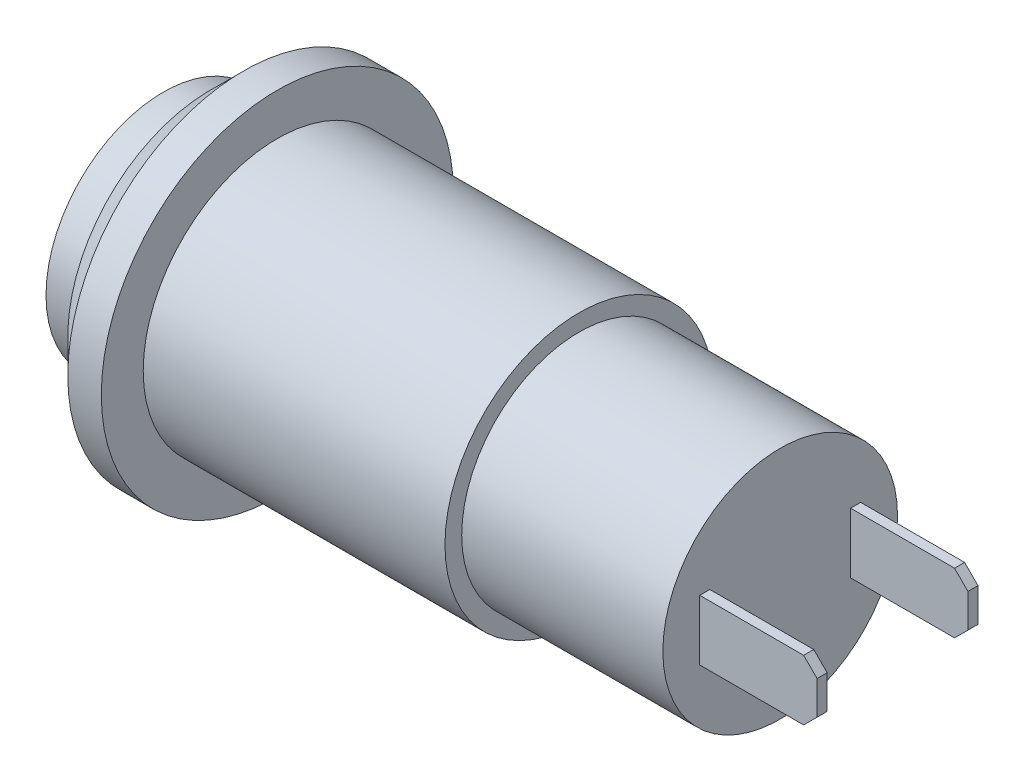
ISO-10303-21;
HEADER;
FILE_DESCRIPTION(('STEP AP214'),'2;1');
FILE_NAME('part.step','',(''),(''),'','','');
FILE_SCHEMA(('AUTOMOTIVE_DESIGN { 1 0 10303 214 1 1 1 1 }'));
ENDSEC;
DATA;
#1=APPLICATION_CONTEXT('core data for automotive mechanical design processes');
#2=APPLICATION_PROTOCOL_DEFINITION('international standard','automotive_design',2000,#1);
#3=PRODUCT_CONTEXT('',#1,'mechanical');
#4=PRODUCT('Part','Part','',(#3));
#5=PRODUCT_RELATED_PRODUCT_CATEGORY('part','',(#4));
#6=PRODUCT_DEFINITION_FORMATION('','',#4);
#7=PRODUCT_DEFINITION_CONTEXT('part definition',#1,'design');
#8=PRODUCT_DEFINITION('design','',#6,#7);
#9=PRODUCT_DEFINITION_SHAPE('','',#8);
#10=(LENGTH_UNIT() NAMED_UNIT(*) SI_UNIT(.MILLI.,.METRE.));
#11=(NAMED_UNIT(*) PLANE_ANGLE_UNIT() SI_UNIT($,.RADIAN.));
#12=(NAMED_UNIT(*) SI_UNIT($,.STERADIAN.) SOLID_ANGLE_UNIT());
#13=UNCERTAINTY_MEASURE_WITH_UNIT(LENGTH_MEASURE(1.E-05),#10,'distance_accuracy_value','');
#14=(GEOMETRIC_REPRESENTATION_CONTEXT(3) GLOBAL_UNCERTAINTY_ASSIGNED_CONTEXT((#13)) GLOBAL_UNIT_ASSIGNED_CONTEXT((#10,
#11,#12)) REPRESENTATION_CONTEXT('',''));
#15=CARTESIAN_POINT('',(0.,0.,0.));
#16=DIRECTION('',(0.,0.,1.));
#17=DIRECTION('',(1.,0.,0.));
#18=AXIS2_PLACEMENT_3D('',#15,#16,#17);
#19=CARTESIAN_POINT('',(18.4,0.,0.));
#20=DIRECTION('',(-1.,0.,0.));
#21=DIRECTION('',(0.,0.,1.));
#22=AXIS2_PLACEMENT_3D('',#19,#20,#21);
#23=PLANE('',#22);
#24=DIRECTION('',(0.,1.,0.));
#25=VECTOR('',#24,1.);
#26=CARTESIAN_POINT('',(18.4,0.900000000000001,-2.4));
#27=LINE('',#26,#25);
#28=CARTESIAN_POINT('',(18.4,-0.899999999999999,-2.4));
#29=VERTEX_POINT('',#28);
#30=CARTESIAN_POINT('',(18.4,0.900000000000001,-2.4));
#31=VERTEX_POINT('',#30);
#32=EDGE_CURVE('E174',#29,#31,#27,.T.);
#33=ORIENTED_EDGE('',*,*,#32,.F.);
#34=DIRECTION('',(0.,0.,-1.));
#35=VECTOR('',#34,1.);
#36=CARTESIAN_POINT('',(18.4,-0.899999999999999,-2.1));
#37=LINE('',#36,#35);
#38=CARTESIAN_POINT('',(18.4,-0.899999999999999,-2.1));
#39=VERTEX_POINT('',#38);
#40=EDGE_CURVE('E180',#39,#29,#37,.T.);
#41=ORIENTED_EDGE('',*,*,#40,.F.);
#42=DIRECTION('',(0.,-1.,0.));
#43=VECTOR('',#42,1.);
#44=CARTESIAN_POINT('',(18.4,0.900000000000001,-2.1));
#45=LINE('',#44,#43);
#46=CARTESIAN_POINT('',(18.4,0.900000000000001,-2.1));
#47=VERTEX_POINT('',#46);
#48=EDGE_CURVE('E192',#47,#39,#45,.T.);
#49=ORIENTED_EDGE('',*,*,#48,.F.);
#50=DIRECTION('',(0.,0.,1.));
#51=VECTOR('',#50,1.);
#52=CARTESIAN_POINT('',(18.4,0.900000000000001,-2.1));
#53=LINE('',#52,#51);
#54=EDGE_CURVE('E188',#31,#47,#53,.T.);
#55=ORIENTED_EDGE('',*,*,#54,.F.);
#56=EDGE_LOOP('',(#33,#41,#49,#55));
#57=FACE_BOUND('',#56,.T.);
#58=CARTESIAN_POINT('',(18.4,0.,0.));
#59=DIRECTION('',(-1.,0.,0.));
#60=DIRECTION('',(0.,0.,1.));
#61=AXIS2_PLACEMENT_3D('',#58,#59,#60);
#62=CIRCLE('',#61,3.5);
#63=CARTESIAN_POINT('',(18.4,0.,3.5));
#64=VERTEX_POINT('',#63);
#65=EDGE_CURVE('E234',#64,#64,#62,.T.);
#66=ORIENTED_EDGE('',*,*,#65,.F.);
#67=EDGE_LOOP('',(#66));
#68=FACE_BOUND('',#67,.T.);
#69=DIRECTION('',(0.,0.,1.));
#70=VECTOR('',#69,1.);
#71=CARTESIAN_POINT('',(18.4,0.899999999999999,2.1));
#72=LINE('',#71,#70);
#73=CARTESIAN_POINT('',(18.4,0.899999999999999,2.1));
#74=VERTEX_POINT('',#73);
#75=CARTESIAN_POINT('',(18.4,0.899999999999999,2.4));
#76=VERTEX_POINT('',#75);
#77=EDGE_CURVE('E134',#74,#76,#72,.T.);
#78=ORIENTED_EDGE('',*,*,#77,.F.);
#79=DIRECTION('',(0.,1.,0.));
#80=VECTOR('',#79,1.);
#81=CARTESIAN_POINT('',(18.4,0.899999999999999,2.1));
#82=LINE('',#81,#80);
#83=CARTESIAN_POINT('',(18.4,-0.899999999999999,2.1));
#84=VERTEX_POINT('',#83);
#85=EDGE_CURVE('E147',#84,#74,#82,.T.);
#86=ORIENTED_EDGE('',*,*,#85,.F.);
#87=DIRECTION('',(0.,0.,-1.));
#88=VECTOR('',#87,1.);
#89=CARTESIAN_POINT('',(18.4,-0.899999999999999,2.1));
#90=LINE('',#89,#88);
#91=CARTESIAN_POINT('',(18.4,-0.899999999999999,2.4));
#92=VERTEX_POINT('',#91);
#93=EDGE_CURVE('E157',#92,#84,#90,.T.);
#94=ORIENTED_EDGE('',*,*,#93,.F.);
#95=DIRECTION('',(0.,-1.,0.));
#96=VECTOR('',#95,1.);
#97=CARTESIAN_POINT('',(18.4,0.899999999999999,2.4));
#98=LINE('',#97,#96);
#99=EDGE_CURVE('E150',#76,#92,#98,.T.);
#100=ORIENTED_EDGE('',*,*,#99,.F.);
#101=EDGE_LOOP('',(#78,#86,#94,#100));
#102=FACE_BOUND('',#101,.T.);
#103=ADVANCED_FACE('F41',(#57,#68,#102),#23,.F.);
#104=CARTESIAN_POINT('',(0.,0.,0.));
#105=DIRECTION('',(-1.,0.,0.));
#106=DIRECTION('',(0.,0.,1.));
#107=AXIS2_PLACEMENT_3D('',#104,#105,#106);
#108=CYLINDRICAL_SURFACE('',#107,3.5);
#109=CARTESIAN_POINT('',(12.4,0.,0.));
#110=DIRECTION('',(-1.,0.,0.));
#111=DIRECTION('',(0.,0.,1.));
#112=AXIS2_PLACEMENT_3D('',#109,#110,#111);
#113=CIRCLE('',#112,3.5);
#114=CARTESIAN_POINT('',(12.4,0.,3.5));
#115=VERTEX_POINT('',#114);
#116=EDGE_CURVE('E230',#115,#115,#113,.T.);
#117=ORIENTED_EDGE('',*,*,#116,.F.);
#118=EDGE_LOOP('',(#117));
#119=FACE_BOUND('',#118,.T.);
#120=ORIENTED_EDGE('',*,*,#65,.T.);
#121=EDGE_LOOP('',(#120));
#122=FACE_BOUND('',#121,.T.);
#123=ADVANCED_FACE('F310',(#119,#122),#108,.T.);
#124=CARTESIAN_POINT('',(12.4,3.5,0.));
#125=DIRECTION('',(-1.,0.,0.));
#126=DIRECTION('',(0.,0.,1.));
#127=AXIS2_PLACEMENT_3D('',#124,#125,#126);
#128=PLANE('',#127);
#129=CARTESIAN_POINT('',(12.4,0.,0.));
#130=DIRECTION('',(-1.,0.,0.));
#131=DIRECTION('',(0.,0.,1.));
#132=AXIS2_PLACEMENT_3D('',#129,#130,#131);
#133=CIRCLE('',#132,4.);
#134=CARTESIAN_POINT('',(12.4,0.,4.));
#135=VERTEX_POINT('',#134);
#136=EDGE_CURVE('E226',#135,#135,#133,.T.);
#137=ORIENTED_EDGE('',*,*,#136,.F.);
#138=EDGE_LOOP('',(#137));
#139=FACE_BOUND('',#138,.T.);
#140=ORIENTED_EDGE('',*,*,#116,.T.);
#141=EDGE_LOOP('',(#140));
#142=FACE_BOUND('',#141,.T.);
#143=ADVANCED_FACE('F316',(#139,#142),#128,.F.);
#144=CARTESIAN_POINT('',(0.,0.,0.));
#145=DIRECTION('',(-1.,0.,0.));
#146=DIRECTION('',(0.,0.,1.));
#147=AXIS2_PLACEMENT_3D('',#144,#145,#146);
#148=CYLINDRICAL_SURFACE('',#147,4.);
#149=CARTESIAN_POINT('',(3.4,0.,0.));
#150=DIRECTION('',(-1.,0.,0.));
#151=DIRECTION('',(0.,0.,1.));
#152=AXIS2_PLACEMENT_3D('',#149,#150,#151);
#153=CIRCLE('',#152,4.);
#154=CARTESIAN_POINT('',(3.4,0.,4.));
#155=VERTEX_POINT('',#154);
#156=EDGE_CURVE('E222',#155,#155,#153,.T.);
#157=ORIENTED_EDGE('',*,*,#156,.F.);
#158=EDGE_LOOP('',(#157));
#159=FACE_BOUND('',#158,.T.);
#160=ORIENTED_EDGE('',*,*,#136,.T.);
#161=EDGE_LOOP('',(#160));
#162=FACE_BOUND('',#161,.T.);
#163=ADVANCED_FACE('F389',(#159,#162),#148,.T.);
#164=CARTESIAN_POINT('',(3.4,4.,0.));
#165=DIRECTION('',(-1.,0.,0.));
#166=DIRECTION('',(0.,0.,1.));
#167=AXIS2_PLACEMENT_3D('',#164,#165,#166);
#168=PLANE('',#167);
#169=CARTESIAN_POINT('',(3.4,0.,0.));
#170=DIRECTION('',(-1.,0.,0.));
#171=DIRECTION('',(0.,0.,1.));
#172=AXIS2_PLACEMENT_3D('',#169,#170,#171);
#173=CIRCLE('',#172,5.25);
#174=CARTESIAN_POINT('',(3.4,0.,5.25));
#175=VERTEX_POINT('',#174);
#176=EDGE_CURVE('E218',#175,#175,#173,.T.);
#177=ORIENTED_EDGE('',*,*,#176,.F.);
#178=EDGE_LOOP('',(#177));
#179=FACE_BOUND('',#178,.T.);
#180=ORIENTED_EDGE('',*,*,#156,.T.);
#181=EDGE_LOOP('',(#180));
#182=FACE_BOUND('',#181,.T.);
#183=ADVANCED_FACE('F385',(#179,#182),#168,.F.);
#184=CARTESIAN_POINT('',(0.,0.,0.));
#185=DIRECTION('',(-1.,0.,0.));
#186=DIRECTION('',(0.,0.,1.));
#187=AXIS2_PLACEMENT_3D('',#184,#185,#186);
#188=CYLINDRICAL_SURFACE('',#187,5.25);
#189=CARTESIAN_POINT('',(2.4,0.,0.));
#190=DIRECTION('',(1.,0.,0.));
#191=DIRECTION('',(0.,0.,-1.));
#192=AXIS2_PLACEMENT_3D('',#189,#190,#191);
#193=CIRCLE('',#192,5.25);
#194=CARTESIAN_POINT('',(2.4,0.,-5.25));
#195=VERTEX_POINT('',#194);
#196=EDGE_CURVE('E242',#195,#195,#193,.T.);
#197=ORIENTED_EDGE('',*,*,#196,.T.);
#198=EDGE_LOOP('',(#197));
#199=FACE_BOUND('',#198,.T.);
#200=ORIENTED_EDGE('',*,*,#176,.T.);
#201=EDGE_LOOP('',(#200));
#202=FACE_BOUND('',#201,.T.);
#203=ADVANCED_FACE('F381',(#199,#202),#188,.T.);
#204=CARTESIAN_POINT('',(1.4,5.25,0.));
#205=DIRECTION('',(1.,0.,0.));
#206=DIRECTION('',(0.,0.,-1.));
#207=AXIS2_PLACEMENT_3D('',#204,#205,#206);
#208=PLANE('',#207);
#209=CARTESIAN_POINT('',(1.4,0.,0.));
#210=DIRECTION('',(1.,0.,0.));
#211=DIRECTION('',(0.,0.,-1.));
#212=AXIS2_PLACEMENT_3D('',#209,#210,#211);
#213=CIRCLE('',#212,4.25000000000001);
#214=CARTESIAN_POINT('',(1.4,0.,-4.25000000000001));
#215=VERTEX_POINT('',#214);
#216=EDGE_CURVE('E238',#215,#215,#213,.F.);
#217=ORIENTED_EDGE('',*,*,#216,.T.);
#218=EDGE_LOOP('',(#217));
#219=FACE_BOUND('',#218,.T.);
#220=CARTESIAN_POINT('',(1.4,0.,0.));
#221=DIRECTION('',(-1.,0.,0.));
#222=DIRECTION('',(0.,0.,1.));
#223=AXIS2_PLACEMENT_3D('',#220,#221,#222);
#224=CIRCLE('',#223,3.5);
#225=CARTESIAN_POINT('',(1.4,0.,3.5));
#226=VERTEX_POINT('',#225);
#227=EDGE_CURVE('E214',#226,#226,#224,.T.);
#228=ORIENTED_EDGE('',*,*,#227,.F.);
#229=EDGE_LOOP('',(#228));
#230=FACE_BOUND('',#229,.T.);
#231=ADVANCED_FACE('F377',(#219,#230),#208,.F.);
#232=CARTESIAN_POINT('',(0.,0.,0.));
#233=DIRECTION('',(-1.,0.,0.));
#234=DIRECTION('',(0.,0.,1.));
#235=AXIS2_PLACEMENT_3D('',#232,#233,#234);
#236=CYLINDRICAL_SURFACE('',#235,3.5);
#237=CARTESIAN_POINT('',(0.,0.,0.));
#238=DIRECTION('',(-1.,0.,0.));
#239=DIRECTION('',(0.,0.,1.));
#240=AXIS2_PLACEMENT_3D('',#237,#238,#239);
#241=CIRCLE('',#240,3.5);
#242=CARTESIAN_POINT('',(0.,0.,3.5));
#243=VERTEX_POINT('',#242);
#244=EDGE_CURVE('E210',#243,#243,#241,.T.);
#245=ORIENTED_EDGE('',*,*,#244,.F.);
#246=EDGE_LOOP('',(#245));
#247=FACE_BOUND('',#246,.T.);
#248=ORIENTED_EDGE('',*,*,#227,.T.);
#249=EDGE_LOOP('',(#248));
#250=FACE_BOUND('',#249,.T.);
#251=ADVANCED_FACE('F373',(#247,#250),#236,.T.);
#252=CARTESIAN_POINT('',(0.,3.5,0.));
#253=DIRECTION('',(1.,0.,0.));
#254=DIRECTION('',(0.,0.,-1.));
#255=AXIS2_PLACEMENT_3D('',#252,#253,#254);
#256=PLANE('',#255);
#257=ORIENTED_EDGE('',*,*,#244,.T.);
#258=EDGE_LOOP('',(#257));
#259=FACE_BOUND('',#258,.T.);
#260=ADVANCED_FACE('F327',(#259),#256,.F.);
#261=CARTESIAN_POINT('',(1.4,0.,0.));
#262=DIRECTION('',(1.,0.,0.));
#263=DIRECTION('',(0.,0.,-1.));
#264=AXIS2_PLACEMENT_3D('',#261,#262,#263);
#265=CONICAL_SURFACE('',#264,4.25000000000001,0.785398163397444);
#266=ORIENTED_EDGE('',*,*,#196,.F.);
#267=EDGE_LOOP('',(#266));
#268=FACE_BOUND('',#267,.T.);
#269=ORIENTED_EDGE('',*,*,#216,.F.);
#270=EDGE_LOOP('',(#269));
#271=FACE_BOUND('',#270,.T.);
#272=ADVANCED_FACE('F323',(#268,#271),#265,.T.);
#273=CARTESIAN_POINT('',(21.9,0.900000000000001,-2.4));
#274=DIRECTION('',(0.,0.,1.));
#275=DIRECTION('',(1.,0.,0.));
#276=AXIS2_PLACEMENT_3D('',#273,#274,#275);
#277=PLANE('',#276);
#278=DIRECTION('',(0.,1.,0.));
#279=VECTOR('',#278,1.);
#280=CARTESIAN_POINT('',(21.9,0.900000000000001,-2.4));
#281=LINE('',#280,#279);
#282=CARTESIAN_POINT('',(21.9,-0.500000000000001,-2.4));
#283=VERTEX_POINT('',#282);
#284=CARTESIAN_POINT('',(21.9,0.500000000000004,-2.4));
#285=VERTEX_POINT('',#284);
#286=EDGE_CURVE('E175',#283,#285,#281,.T.);
#287=ORIENTED_EDGE('',*,*,#286,.F.);
#288=DIRECTION('',(-0.707106781186551,-0.707106781186544,0.));
#289=VECTOR('',#288,1.);
#290=CARTESIAN_POINT('',(21.9,-0.500000000000001,-2.4));
#291=LINE('',#290,#289);
#292=CARTESIAN_POINT('',(21.5,-0.899999999999999,-2.4));
#293=VERTEX_POINT('',#292);
#294=EDGE_CURVE('E257',#283,#293,#291,.T.);
#295=ORIENTED_EDGE('',*,*,#294,.T.);
#296=DIRECTION('',(-1.,0.,0.));
#297=VECTOR('',#296,1.);
#298=CARTESIAN_POINT('',(21.9,-0.899999999999999,-2.4));
#299=LINE('',#298,#297);
#300=EDGE_CURVE('E184',#293,#29,#299,.T.);
#301=ORIENTED_EDGE('',*,*,#300,.T.);
#302=ORIENTED_EDGE('',*,*,#32,.T.);
#303=DIRECTION('',(-1.,0.,0.));
#304=VECTOR('',#303,1.);
#305=CARTESIAN_POINT('',(21.9,0.900000000000001,-2.4));
#306=LINE('',#305,#304);
#307=CARTESIAN_POINT('',(21.5,0.900000000000001,-2.4));
#308=VERTEX_POINT('',#307);
#309=EDGE_CURVE('E207',#308,#31,#306,.T.);
#310=ORIENTED_EDGE('',*,*,#309,.F.);
#311=DIRECTION('',(0.707106781186551,-0.707106781186544,0.));
#312=VECTOR('',#311,1.);
#313=CARTESIAN_POINT('',(21.9,0.500000000000004,-2.4));
#314=LINE('',#313,#312);
#315=EDGE_CURVE('E254',#308,#285,#314,.T.);
#316=ORIENTED_EDGE('',*,*,#315,.T.);
#317=EDGE_LOOP('',(#287,#295,#301,#302,#310,#316));
#318=FACE_BOUND('',#317,.T.);
#319=ADVANCED_FACE('F326',(#318),#277,.F.);
#320=CARTESIAN_POINT('',(21.9,0.900000000000001,-2.1));
#321=DIRECTION('',(0.,-1.,0.));
#322=DIRECTION('',(0.,0.,-1.));
#323=AXIS2_PLACEMENT_3D('',#320,#321,#322);
#324=PLANE('',#323);
#325=DIRECTION('',(-1.,0.,0.));
#326=VECTOR('',#325,1.);
#327=CARTESIAN_POINT('',(21.9,0.900000000000001,-2.1));
#328=LINE('',#327,#326);
#329=CARTESIAN_POINT('',(21.5,0.900000000000001,-2.1));
#330=VERTEX_POINT('',#329);
#331=EDGE_CURVE('E204',#330,#47,#328,.T.);
#332=ORIENTED_EDGE('',*,*,#331,.F.);
#333=DIRECTION('',(0.,0.,-1.));
#334=VECTOR('',#333,1.);
#335=CARTESIAN_POINT('',(21.5,0.900000000000001,-2.4));
#336=LINE('',#335,#334);
#337=EDGE_CURVE('E269',#330,#308,#336,.T.);
#338=ORIENTED_EDGE('',*,*,#337,.T.);
#339=ORIENTED_EDGE('',*,*,#309,.T.);
#340=ORIENTED_EDGE('',*,*,#54,.T.);
#341=EDGE_LOOP('',(#332,#338,#339,#340));
#342=FACE_BOUND('',#341,.T.);
#343=ADVANCED_FACE('F360',(#342),#324,.F.);
#344=CARTESIAN_POINT('',(21.9,0.900000000000001,-2.1));
#345=DIRECTION('',(0.,0.,-1.));
#346=DIRECTION('',(0.,1.,0.));
#347=AXIS2_PLACEMENT_3D('',#344,#345,#346);
#348=PLANE('',#347);
#349=DIRECTION('',(-1.,0.,0.));
#350=VECTOR('',#349,1.);
#351=CARTESIAN_POINT('',(21.9,-0.899999999999999,-2.1));
#352=LINE('',#351,#350);
#353=CARTESIAN_POINT('',(21.5,-0.899999999999999,-2.1));
#354=VERTEX_POINT('',#353);
#355=EDGE_CURVE('E201',#354,#39,#352,.T.);
#356=ORIENTED_EDGE('',*,*,#355,.F.);
#357=DIRECTION('',(0.707106781186551,0.707106781186544,0.));
#358=VECTOR('',#357,1.);
#359=CARTESIAN_POINT('',(21.9,-0.500000000000001,-2.1));
#360=LINE('',#359,#358);
#361=CARTESIAN_POINT('',(21.9,-0.500000000000001,-2.1));
#362=VERTEX_POINT('',#361);
#363=EDGE_CURVE('E266',#354,#362,#360,.T.);
#364=ORIENTED_EDGE('',*,*,#363,.T.);
#365=DIRECTION('',(0.,-1.,0.));
#366=VECTOR('',#365,1.);
#367=CARTESIAN_POINT('',(21.9,0.900000000000001,-2.1));
#368=LINE('',#367,#366);
#369=CARTESIAN_POINT('',(21.9,0.500000000000004,-2.1));
#370=VERTEX_POINT('',#369);
#371=EDGE_CURVE('E179',#370,#362,#368,.T.);
#372=ORIENTED_EDGE('',*,*,#371,.F.);
#373=DIRECTION('',(-0.707106781186551,0.707106781186544,0.));
#374=VECTOR('',#373,1.);
#375=CARTESIAN_POINT('',(21.9,0.500000000000004,-2.1));
#376=LINE('',#375,#374);
#377=EDGE_CURVE('E263',#370,#330,#376,.T.);
#378=ORIENTED_EDGE('',*,*,#377,.T.);
#379=ORIENTED_EDGE('',*,*,#331,.T.);
#380=ORIENTED_EDGE('',*,*,#48,.T.);
#381=EDGE_LOOP('',(#356,#364,#372,#378,#379,#380));
#382=FACE_BOUND('',#381,.T.);
#383=ADVANCED_FACE('F357',(#382),#348,.F.);
#384=CARTESIAN_POINT('',(21.9,-0.899999999999999,-2.1));
#385=DIRECTION('',(0.,1.,0.));
#386=DIRECTION('',(0.,0.,1.));
#387=AXIS2_PLACEMENT_3D('',#384,#385,#386);
#388=PLANE('',#387);
#389=ORIENTED_EDGE('',*,*,#300,.F.);
#390=DIRECTION('',(0.,0.,1.));
#391=VECTOR('',#390,1.);
#392=CARTESIAN_POINT('',(21.5,-0.899999999999999,-2.1));
#393=LINE('',#392,#391);
#394=EDGE_CURVE('E260',#293,#354,#393,.T.);
#395=ORIENTED_EDGE('',*,*,#394,.T.);
#396=ORIENTED_EDGE('',*,*,#355,.T.);
#397=ORIENTED_EDGE('',*,*,#40,.T.);
#398=EDGE_LOOP('',(#389,#395,#396,#397));
#399=FACE_BOUND('',#398,.T.);
#400=ADVANCED_FACE('F351',(#399),#388,.F.);
#401=CARTESIAN_POINT('',(21.9,0.,0.));
#402=DIRECTION('',(1.,0.,0.));
#403=DIRECTION('',(0.,0.,-1.));
#404=AXIS2_PLACEMENT_3D('',#401,#402,#403);
#405=PLANE('',#404);
#406=ORIENTED_EDGE('',*,*,#371,.T.);
#407=DIRECTION('',(0.,0.,-1.));
#408=VECTOR('',#407,1.);
#409=CARTESIAN_POINT('',(21.9,-0.500000000000001,-2.4));
#410=LINE('',#409,#408);
#411=EDGE_CURVE('E250',#362,#283,#410,.T.);
#412=ORIENTED_EDGE('',*,*,#411,.T.);
#413=ORIENTED_EDGE('',*,*,#286,.T.);
#414=DIRECTION('',(0.,0.,1.));
#415=VECTOR('',#414,1.);
#416=CARTESIAN_POINT('',(21.9,0.500000000000004,-2.1));
#417=LINE('',#416,#415);
#418=EDGE_CURVE('E246',#285,#370,#417,.T.);
#419=ORIENTED_EDGE('',*,*,#418,.T.);
#420=EDGE_LOOP('',(#406,#412,#413,#419));
#421=FACE_BOUND('',#420,.T.);
#422=ADVANCED_FACE('F344',(#421),#405,.T.);
#423=CARTESIAN_POINT('',(21.9,0.899999999999999,2.1));
#424=DIRECTION('',(0.,-1.,0.));
#425=DIRECTION('',(0.,0.,-1.));
#426=AXIS2_PLACEMENT_3D('',#423,#424,#425);
#427=PLANE('',#426);
#428=DIRECTION('',(-1.,0.,0.));
#429=VECTOR('',#428,1.);
#430=CARTESIAN_POINT('',(21.9,0.899999999999999,2.4));
#431=LINE('',#430,#429);
#432=CARTESIAN_POINT('',(21.5,0.899999999999999,2.4));
#433=VERTEX_POINT('',#432);
#434=EDGE_CURVE('E171',#433,#76,#431,.T.);
#435=ORIENTED_EDGE('',*,*,#434,.F.);
#436=DIRECTION('',(0.,0.,-1.));
#437=VECTOR('',#436,1.);
#438=CARTESIAN_POINT('',(21.5,0.899999999999999,2.1));
#439=LINE('',#438,#437);
#440=CARTESIAN_POINT('',(21.5,0.899999999999999,2.1));
#441=VERTEX_POINT('',#440);
#442=EDGE_CURVE('E11',#433,#441,#439,.T.);
#443=ORIENTED_EDGE('',*,*,#442,.T.);
#444=DIRECTION('',(-1.,0.,0.));
#445=VECTOR('',#444,1.);
#446=CARTESIAN_POINT('',(21.9,0.899999999999999,2.1));
#447=LINE('',#446,#445);
#448=EDGE_CURVE('E131',#441,#74,#447,.T.);
#449=ORIENTED_EDGE('',*,*,#448,.T.);
#450=ORIENTED_EDGE('',*,*,#77,.T.);
#451=EDGE_LOOP('',(#435,#443,#449,#450));
#452=FACE_BOUND('',#451,.T.);
#453=ADVANCED_FACE('F133',(#452),#427,.F.);
#454=CARTESIAN_POINT('',(21.9,0.899999999999999,2.4));
#455=DIRECTION('',(0.,0.,-1.));
#456=DIRECTION('',(-1.,0.,0.));
#457=AXIS2_PLACEMENT_3D('',#454,#455,#456);
#458=PLANE('',#457);
#459=DIRECTION('',(-1.,0.,0.));
#460=VECTOR('',#459,1.);
#461=CARTESIAN_POINT('',(21.9,-0.899999999999999,2.4));
#462=LINE('',#461,#460);
#463=CARTESIAN_POINT('',(21.5,-0.899999999999999,2.4));
#464=VERTEX_POINT('',#463);
#465=EDGE_CURVE('E168',#464,#92,#462,.T.);
#466=ORIENTED_EDGE('',*,*,#465,.F.);
#467=DIRECTION('',(0.707106781186551,0.707106781186544,0.));
#468=VECTOR('',#467,1.);
#469=CARTESIAN_POINT('',(21.9,-0.500000000000002,2.4));
#470=LINE('',#469,#468);
#471=CARTESIAN_POINT('',(21.9,-0.500000000000002,2.4));
#472=VERTEX_POINT('',#471);
#473=EDGE_CURVE('E50',#464,#472,#470,.T.);
#474=ORIENTED_EDGE('',*,*,#473,.T.);
#475=DIRECTION('',(0.,-1.,0.));
#476=VECTOR('',#475,1.);
#477=CARTESIAN_POINT('',(21.9,0.899999999999999,2.4));
#478=LINE('',#477,#476);
#479=CARTESIAN_POINT('',(21.9,0.500000000000002,2.4));
#480=VERTEX_POINT('',#479);
#481=EDGE_CURVE('E156',#480,#472,#478,.T.);
#482=ORIENTED_EDGE('',*,*,#481,.F.);
#483=DIRECTION('',(-0.707106781186551,0.707106781186544,0.));
#484=VECTOR('',#483,1.);
#485=CARTESIAN_POINT('',(21.9,0.500000000000002,2.4));
#486=LINE('',#485,#484);
#487=EDGE_CURVE('E57',#480,#433,#486,.T.);
#488=ORIENTED_EDGE('',*,*,#487,.T.);
#489=ORIENTED_EDGE('',*,*,#434,.T.);
#490=ORIENTED_EDGE('',*,*,#99,.T.);
#491=EDGE_LOOP('',(#466,#474,#482,#488,#489,#490));
#492=FACE_BOUND('',#491,.T.);
#493=ADVANCED_FACE('F291',(#492),#458,.F.);
#494=CARTESIAN_POINT('',(21.9,-0.899999999999999,2.1));
#495=DIRECTION('',(0.,1.,0.));
#496=DIRECTION('',(0.,0.,1.));
#497=AXIS2_PLACEMENT_3D('',#494,#495,#496);
#498=PLANE('',#497);
#499=DIRECTION('',(-1.,0.,0.));
#500=VECTOR('',#499,1.);
#501=CARTESIAN_POINT('',(21.9,-0.899999999999999,2.1));
#502=LINE('',#501,#500);
#503=CARTESIAN_POINT('',(21.5,-0.899999999999999,2.1));
#504=VERTEX_POINT('',#503);
#505=EDGE_CURVE('E140',#504,#84,#502,.T.);
#506=ORIENTED_EDGE('',*,*,#505,.F.);
#507=DIRECTION('',(0.,0.,1.));
#508=VECTOR('',#507,1.);
#509=CARTESIAN_POINT('',(21.5,-0.899999999999999,2.4));
#510=LINE('',#509,#508);
#511=EDGE_CURVE('E65',#504,#464,#510,.T.);
#512=ORIENTED_EDGE('',*,*,#511,.T.);
#513=ORIENTED_EDGE('',*,*,#465,.T.);
#514=ORIENTED_EDGE('',*,*,#93,.T.);
#515=EDGE_LOOP('',(#506,#512,#513,#514));
#516=FACE_BOUND('',#515,.T.);
#517=ADVANCED_FACE('F299',(#516),#498,.F.);
#518=CARTESIAN_POINT('',(21.9,0.899999999999999,2.1));
#519=DIRECTION('',(0.,0.,1.));
#520=DIRECTION('',(0.,-1.,0.));
#521=AXIS2_PLACEMENT_3D('',#518,#519,#520);
#522=PLANE('',#521);
#523=DIRECTION('',(0.,1.,0.));
#524=VECTOR('',#523,1.);
#525=CARTESIAN_POINT('',(21.9,0.899999999999999,2.1));
#526=LINE('',#525,#524);
#527=CARTESIAN_POINT('',(21.9,-0.500000000000002,2.1));
#528=VERTEX_POINT('',#527);
#529=CARTESIAN_POINT('',(21.9,0.500000000000002,2.1));
#530=VERTEX_POINT('',#529);
#531=EDGE_CURVE('E141',#528,#530,#526,.T.);
#532=ORIENTED_EDGE('',*,*,#531,.F.);
#533=DIRECTION('',(-0.707106781186551,-0.707106781186544,0.));
#534=VECTOR('',#533,1.);
#535=CARTESIAN_POINT('',(21.9,-0.500000000000001,2.1));
#536=LINE('',#535,#534);
#537=EDGE_CURVE('E283',#528,#504,#536,.T.);
#538=ORIENTED_EDGE('',*,*,#537,.T.);
#539=ORIENTED_EDGE('',*,*,#505,.T.);
#540=ORIENTED_EDGE('',*,*,#85,.T.);
#541=ORIENTED_EDGE('',*,*,#448,.F.);
#542=DIRECTION('',(0.707106781186551,-0.707106781186544,0.));
#543=VECTOR('',#542,1.);
#544=CARTESIAN_POINT('',(21.9,0.500000000000002,2.1));
#545=LINE('',#544,#543);
#546=EDGE_CURVE('E280',#441,#530,#545,.T.);
#547=ORIENTED_EDGE('',*,*,#546,.T.);
#548=EDGE_LOOP('',(#532,#538,#539,#540,#541,#547));
#549=FACE_BOUND('',#548,.T.);
#550=ADVANCED_FACE('F154',(#549),#522,.F.);
#551=CARTESIAN_POINT('',(21.9,0.,0.));
#552=DIRECTION('',(1.,0.,0.));
#553=DIRECTION('',(0.,0.,-1.));
#554=AXIS2_PLACEMENT_3D('',#551,#552,#553);
#555=PLANE('',#554);
#556=ORIENTED_EDGE('',*,*,#481,.T.);
#557=DIRECTION('',(0.,0.,-1.));
#558=VECTOR('',#557,1.);
#559=CARTESIAN_POINT('',(21.9,-0.500000000000002,2.1));
#560=LINE('',#559,#558);
#561=EDGE_CURVE('E276',#472,#528,#560,.T.);
#562=ORIENTED_EDGE('',*,*,#561,.T.);
#563=ORIENTED_EDGE('',*,*,#531,.T.);
#564=DIRECTION('',(0.,0.,1.));
#565=VECTOR('',#564,1.);
#566=CARTESIAN_POINT('',(21.9,0.500000000000002,2.4));
#567=LINE('',#566,#565);
#568=EDGE_CURVE('E272',#530,#480,#567,.T.);
#569=ORIENTED_EDGE('',*,*,#568,.T.);
#570=EDGE_LOOP('',(#556,#562,#563,#569));
#571=FACE_BOUND('',#570,.T.);
#572=ADVANCED_FACE('F295',(#571),#555,.T.);
#573=CARTESIAN_POINT('',(21.9,-0.500000000000001,0.));
#574=DIRECTION('',(0.707106781186544,-0.707106781186551,0.));
#575=DIRECTION('',(0.,0.,1.));
#576=AXIS2_PLACEMENT_3D('',#573,#574,#575);
#577=PLANE('',#576);
#578=ORIENTED_EDGE('',*,*,#363,.F.);
#579=ORIENTED_EDGE('',*,*,#394,.F.);
#580=ORIENTED_EDGE('',*,*,#294,.F.);
#581=ORIENTED_EDGE('',*,*,#411,.F.);
#582=EDGE_LOOP('',(#578,#579,#580,#581));
#583=FACE_BOUND('',#582,.T.);
#584=ADVANCED_FACE('F329',(#583),#577,.T.);
#585=CARTESIAN_POINT('',(21.9,0.500000000000004,0.));
#586=DIRECTION('',(0.707106781186544,0.707106781186551,0.));
#587=DIRECTION('',(0.,0.,-1.));
#588=AXIS2_PLACEMENT_3D('',#585,#586,#587);
#589=PLANE('',#588);
#590=ORIENTED_EDGE('',*,*,#315,.F.);
#591=ORIENTED_EDGE('',*,*,#337,.F.);
#592=ORIENTED_EDGE('',*,*,#377,.F.);
#593=ORIENTED_EDGE('',*,*,#418,.F.);
#594=EDGE_LOOP('',(#590,#591,#592,#593));
#595=FACE_BOUND('',#594,.T.);
#596=ADVANCED_FACE('F308',(#595),#589,.T.);
#597=CARTESIAN_POINT('',(21.9,-0.500000000000002,0.));
#598=DIRECTION('',(0.707106781186544,-0.707106781186551,0.));
#599=DIRECTION('',(0.,0.,1.));
#600=AXIS2_PLACEMENT_3D('',#597,#598,#599);
#601=PLANE('',#600);
#602=ORIENTED_EDGE('',*,*,#473,.F.);
#603=ORIENTED_EDGE('',*,*,#511,.F.);
#604=ORIENTED_EDGE('',*,*,#537,.F.);
#605=ORIENTED_EDGE('',*,*,#561,.F.);
#606=EDGE_LOOP('',(#602,#603,#604,#605));
#607=FACE_BOUND('',#606,.T.);
#608=ADVANCED_FACE('F298',(#607),#601,.T.);
#609=CARTESIAN_POINT('',(21.9,0.500000000000002,0.));
#610=DIRECTION('',(0.707106781186544,0.707106781186551,0.));
#611=DIRECTION('',(0.,0.,-1.));
#612=AXIS2_PLACEMENT_3D('',#609,#610,#611);
#613=PLANE('',#612);
#614=ORIENTED_EDGE('',*,*,#546,.F.);
#615=ORIENTED_EDGE('',*,*,#442,.F.);
#616=ORIENTED_EDGE('',*,*,#487,.F.);
#617=ORIENTED_EDGE('',*,*,#568,.F.);
#618=EDGE_LOOP('',(#614,#615,#616,#617));
#619=FACE_BOUND('',#618,.T.);
#620=ADVANCED_FACE('F43',(#619),#613,.T.);
#621=CLOSED_SHELL('',(#103,#123,#143,#163,#183,#203,#231,#251,#260,#272,#319,#343,#383,#400,
#422,#453,#493,#517,#550,#572,#584,#596,#608,#620));
#622=MANIFOLD_SOLID_BREP('B2',#621);
#623=ADVANCED_BREP_SHAPE_REPRESENTATION('',(#18,#622),#14);
#624=SHAPE_DEFINITION_REPRESENTATION(#9,#623);
ENDSEC;
END-ISO-10303-21;
